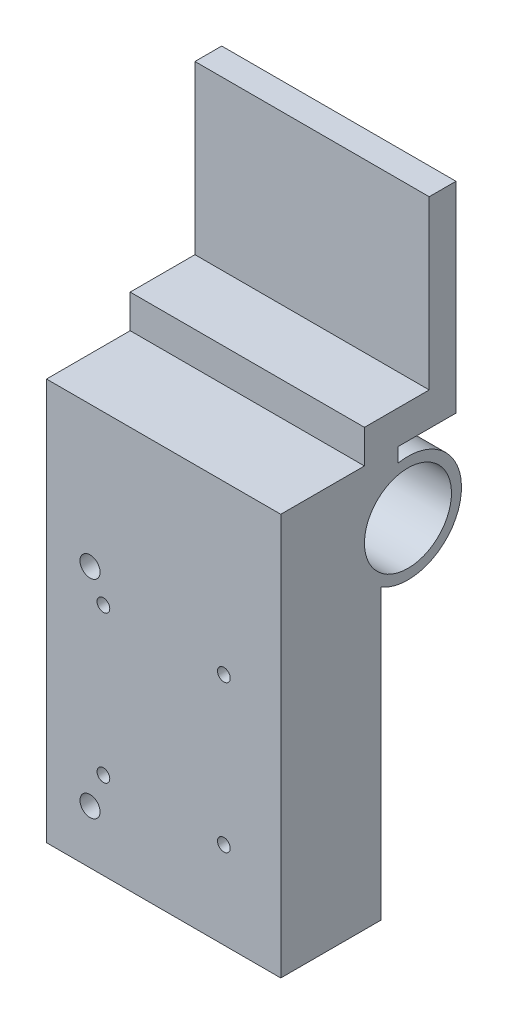
ISO-10303-21;
HEADER;
FILE_DESCRIPTION(('STEP AP214'),'2;1');
FILE_NAME('part.step','',(''),(''),'','','');
FILE_SCHEMA(('AUTOMOTIVE_DESIGN { 1 0 10303 214 1 1 1 1 }'));
ENDSEC;
DATA;
#1=APPLICATION_CONTEXT('core data for automotive mechanical design processes');
#2=APPLICATION_PROTOCOL_DEFINITION('international standard','automotive_design',2000,#1);
#3=PRODUCT_CONTEXT('',#1,'mechanical');
#4=PRODUCT('Part','Part','',(#3));
#5=PRODUCT_RELATED_PRODUCT_CATEGORY('part','',(#4));
#6=PRODUCT_DEFINITION_FORMATION('','',#4);
#7=PRODUCT_DEFINITION_CONTEXT('part definition',#1,'design');
#8=PRODUCT_DEFINITION('design','',#6,#7);
#9=PRODUCT_DEFINITION_SHAPE('','',#8);
#10=(LENGTH_UNIT() NAMED_UNIT(*) SI_UNIT(.MILLI.,.METRE.));
#11=(NAMED_UNIT(*) PLANE_ANGLE_UNIT() SI_UNIT($,.RADIAN.));
#12=(NAMED_UNIT(*) SI_UNIT($,.STERADIAN.) SOLID_ANGLE_UNIT());
#13=UNCERTAINTY_MEASURE_WITH_UNIT(LENGTH_MEASURE(1.E-05),#10,'distance_accuracy_value','');
#14=(GEOMETRIC_REPRESENTATION_CONTEXT(3) GLOBAL_UNCERTAINTY_ASSIGNED_CONTEXT((#13)) GLOBAL_UNIT_ASSIGNED_CONTEXT((#10,
#11,#12)) REPRESENTATION_CONTEXT('',''));
#15=CARTESIAN_POINT('',(0.,0.,0.));
#16=DIRECTION('',(0.,0.,1.));
#17=DIRECTION('',(1.,0.,0.));
#18=AXIS2_PLACEMENT_3D('',#15,#16,#17);
#19=CARTESIAN_POINT('',(0.,60.,0.));
#20=DIRECTION('',(0.,0.,1.));
#21=DIRECTION('',(1.,0.,0.));
#22=AXIS2_PLACEMENT_3D('',#19,#20,#21);
#23=PLANE('',#22);
#24=DIRECTION('',(-1.,0.,0.));
#25=VECTOR('',#24,1.);
#26=CARTESIAN_POINT('',(-23.,56.9282032302755,0.));
#27=LINE('',#26,#25);
#28=CARTESIAN_POINT('',(-12.,56.9282032302755,0.));
#29=VERTEX_POINT('',#28);
#30=CARTESIAN_POINT('',(-23.,56.9282032302755,0.));
#31=VERTEX_POINT('',#30);
#32=EDGE_CURVE('E218',#29,#31,#27,.T.);
#33=ORIENTED_EDGE('',*,*,#32,.F.);
#34=DIRECTION('',(0.,1.,0.));
#35=VECTOR('',#34,1.);
#36=CARTESIAN_POINT('',(-12.,60.,0.));
#37=LINE('',#36,#35);
#38=CARTESIAN_POINT('',(-12.,55.1234753829798,0.));
#39=VERTEX_POINT('',#38);
#40=EDGE_CURVE('E235',#39,#29,#37,.T.);
#41=ORIENTED_EDGE('',*,*,#40,.F.);
#42=DIRECTION('',(-1.,0.,0.));
#43=VECTOR('',#42,1.);
#44=CARTESIAN_POINT('',(0.,55.1234753829798,0.));
#45=LINE('',#44,#43);
#46=CARTESIAN_POINT('',(-23.,55.1234753829798,0.));
#47=VERTEX_POINT('',#46);
#48=EDGE_CURVE('E242',#39,#47,#45,.T.);
#49=ORIENTED_EDGE('',*,*,#48,.T.);
#50=DIRECTION('',(0.,-1.,0.));
#51=VECTOR('',#50,1.);
#52=CARTESIAN_POINT('',(-23.,60.,0.));
#53=LINE('',#52,#51);
#54=EDGE_CURVE('E314',#31,#47,#53,.T.);
#55=ORIENTED_EDGE('',*,*,#54,.F.);
#56=EDGE_LOOP('',(#33,#41,#49,#55));
#57=FACE_BOUND('',#56,.T.);
#58=ADVANCED_FACE('F31',(#57),#23,.F.);
#59=CARTESIAN_POINT('',(0.,0.,15.));
#60=DIRECTION('',(-1.,0.,0.));
#61=DIRECTION('',(0.,0.,1.));
#62=AXIS2_PLACEMENT_3D('',#59,#60,#61);
#63=PLANE('',#62);
#64=DIRECTION('',(0.,1.,0.));
#65=VECTOR('',#64,1.);
#66=CARTESIAN_POINT('',(0.,-0.00100000000000794,2.5));
#67=LINE('',#66,#65);
#68=CARTESIAN_POINT('',(0.,60.,2.5));
#69=VERTEX_POINT('',#68);
#70=CARTESIAN_POINT('',(0.,65.,2.5));
#71=VERTEX_POINT('',#70);
#72=EDGE_CURVE('E211',#69,#71,#67,.T.);
#73=ORIENTED_EDGE('',*,*,#72,.F.);
#74=DIRECTION('',(0.,0.,-1.));
#75=VECTOR('',#74,1.);
#76=CARTESIAN_POINT('',(0.,60.,15.));
#77=LINE('',#76,#75);
#78=CARTESIAN_POINT('',(0.,60.,15.));
#79=VERTEX_POINT('',#78);
#80=EDGE_CURVE('E298',#79,#69,#77,.T.);
#81=ORIENTED_EDGE('',*,*,#80,.F.);
#82=DIRECTION('',(0.,1.,0.));
#83=VECTOR('',#82,1.);
#84=CARTESIAN_POINT('',(0.,0.,15.));
#85=LINE('',#84,#83);
#86=CARTESIAN_POINT('',(0.,0.,15.));
#87=VERTEX_POINT('',#86);
#88=EDGE_CURVE('E274',#87,#79,#85,.T.);
#89=ORIENTED_EDGE('',*,*,#88,.F.);
#90=DIRECTION('',(0.,0.,-1.));
#91=VECTOR('',#90,1.);
#92=CARTESIAN_POINT('',(0.,0.,15.));
#93=LINE('',#92,#91);
#94=CARTESIAN_POINT('',(0.,0.,0.));
#95=VERTEX_POINT('',#94);
#96=EDGE_CURVE('E284',#87,#95,#93,.T.);
#97=ORIENTED_EDGE('',*,*,#96,.T.);
#98=DIRECTION('',(0.,1.,0.));
#99=VECTOR('',#98,1.);
#100=CARTESIAN_POINT('',(0.,0.,0.));
#101=LINE('',#100,#99);
#102=CARTESIAN_POINT('',(0.,43.0717967697245,0.));
#103=VERTEX_POINT('',#102);
#104=EDGE_CURVE('E271',#95,#103,#101,.T.);
#105=ORIENTED_EDGE('',*,*,#104,.T.);
#106=CARTESIAN_POINT('',(0.,50.,-4.00000000000001));
#107=DIRECTION('',(-1.,0.,0.));
#108=DIRECTION('',(0.,-1.,0.));
#109=AXIS2_PLACEMENT_3D('',#106,#107,#108);
#110=CIRCLE('',#109,8.);
#111=CARTESIAN_POINT('',(0.,57.8581168227509,-2.50000000000001));
#112=VERTEX_POINT('',#111);
#113=EDGE_CURVE('E226',#112,#103,#110,.T.);
#114=ORIENTED_EDGE('',*,*,#113,.F.);
#115=DIRECTION('',(0.,1.,0.));
#116=VECTOR('',#115,1.);
#117=CARTESIAN_POINT('',(0.,-0.00100000000000794,-2.50000000000001));
#118=LINE('',#117,#116);
#119=CARTESIAN_POINT('',(0.,60.,-2.5));
#120=VERTEX_POINT('',#119);
#121=EDGE_CURVE('E46',#112,#120,#118,.T.);
#122=ORIENTED_EDGE('',*,*,#121,.T.);
#123=DIRECTION('',(0.,0.,1.));
#124=VECTOR('',#123,1.);
#125=CARTESIAN_POINT('',(0.,60.,-11.175));
#126=LINE('',#125,#124);
#127=CARTESIAN_POINT('',(0.,60.,-11.175));
#128=VERTEX_POINT('',#127);
#129=EDGE_CURVE('E172',#128,#120,#126,.T.);
#130=ORIENTED_EDGE('',*,*,#129,.F.);
#131=DIRECTION('',(0.,-1.,0.));
#132=VECTOR('',#131,1.);
#133=CARTESIAN_POINT('',(0.,90.,-11.175));
#134=LINE('',#133,#132);
#135=CARTESIAN_POINT('',(0.,90.,-11.175));
#136=VERTEX_POINT('',#135);
#137=EDGE_CURVE('E182',#136,#128,#134,.T.);
#138=ORIENTED_EDGE('',*,*,#137,.F.);
#139=DIRECTION('',(0.,0.,-1.));
#140=VECTOR('',#139,1.);
#141=CARTESIAN_POINT('',(0.,90.,-7.17500000000001));
#142=LINE('',#141,#140);
#143=CARTESIAN_POINT('',(0.,90.,-7.17500000000001));
#144=VERTEX_POINT('',#143);
#145=EDGE_CURVE('E179',#144,#136,#142,.T.);
#146=ORIENTED_EDGE('',*,*,#145,.F.);
#147=DIRECTION('',(0.,1.,0.));
#148=VECTOR('',#147,1.);
#149=CARTESIAN_POINT('',(0.,65.,-7.17500000000001));
#150=LINE('',#149,#148);
#151=CARTESIAN_POINT('',(0.,65.,-7.17500000000001));
#152=VERTEX_POINT('',#151);
#153=EDGE_CURVE('E168',#152,#144,#150,.T.);
#154=ORIENTED_EDGE('',*,*,#153,.F.);
#155=DIRECTION('',(0.,0.,-1.));
#156=VECTOR('',#155,1.);
#157=CARTESIAN_POINT('',(0.,65.,2.5));
#158=LINE('',#157,#156);
#159=EDGE_CURVE('E152',#71,#152,#158,.T.);
#160=ORIENTED_EDGE('',*,*,#159,.F.);
#161=EDGE_LOOP('',(#73,#81,#89,#97,#105,#114,#122,#130,#138,#146,#154,#160));
#162=FACE_BOUND('',#161,.T.);
#163=CARTESIAN_POINT('',(0.,50.,-4.00000000000001));
#164=DIRECTION('',(-1.,0.,0.));
#165=DIRECTION('',(0.,-1.,0.));
#166=AXIS2_PLACEMENT_3D('',#163,#164,#165);
#167=CIRCLE('',#166,6.5);
#168=CARTESIAN_POINT('',(0.,43.5,-4.00000000000001));
#169=VERTEX_POINT('',#168);
#170=EDGE_CURVE('E223',#169,#169,#167,.T.);
#171=ORIENTED_EDGE('',*,*,#170,.T.);
#172=EDGE_LOOP('',(#171));
#173=FACE_BOUND('',#172,.T.);
#174=ADVANCED_FACE('F175',(#162,#173),#63,.F.);
#175=CARTESIAN_POINT('',(-12.,50.,-4.00000000000001));
#176=DIRECTION('',(1.,0.,0.));
#177=DIRECTION('',(0.,-1.,0.));
#178=AXIS2_PLACEMENT_3D('',#175,#176,#177);
#179=PLANE('',#178);
#180=CARTESIAN_POINT('',(-12.,50.,-4.00000000000001));
#181=DIRECTION('',(1.,0.,0.));
#182=DIRECTION('',(0.,1.,0.));
#183=AXIS2_PLACEMENT_3D('',#180,#181,#182);
#184=CIRCLE('',#183,6.5);
#185=CARTESIAN_POINT('',(-12.,44.8765246170202,0.));
#186=VERTEX_POINT('',#185);
#187=EDGE_CURVE('E39',#39,#186,#184,.F.);
#188=ORIENTED_EDGE('',*,*,#187,.F.);
#189=ORIENTED_EDGE('',*,*,#40,.T.);
#190=CARTESIAN_POINT('',(-12.,50.,-4.00000000000001));
#191=DIRECTION('',(-1.,0.,0.));
#192=DIRECTION('',(0.,-1.,0.));
#193=AXIS2_PLACEMENT_3D('',#190,#191,#192);
#194=CIRCLE('',#193,8.);
#195=CARTESIAN_POINT('',(-12.,57.8581168227509,-2.5));
#196=VERTEX_POINT('',#195);
#197=EDGE_CURVE('E227',#29,#196,#194,.T.);
#198=ORIENTED_EDGE('',*,*,#197,.T.);
#199=CARTESIAN_POINT('',(-12.,43.0717967697245,0.));
#200=VERTEX_POINT('',#199);
#201=EDGE_CURVE('E231',#196,#200,#194,.T.);
#202=ORIENTED_EDGE('',*,*,#201,.T.);
#203=DIRECTION('',(0.,1.,0.));
#204=VECTOR('',#203,1.);
#205=CARTESIAN_POINT('',(-12.,60.,0.));
#206=LINE('',#205,#204);
#207=EDGE_CURVE('E230',#200,#186,#206,.T.);
#208=ORIENTED_EDGE('',*,*,#207,.T.);
#209=EDGE_LOOP('',(#188,#189,#198,#202,#208));
#210=FACE_BOUND('',#209,.T.);
#211=ADVANCED_FACE('F330',(#210),#179,.F.);
#212=CARTESIAN_POINT('',(-28.5,7.99999999999999,0.));
#213=DIRECTION('',(0.,0.,1.));
#214=DIRECTION('',(1.,0.,0.));
#215=AXIS2_PLACEMENT_3D('',#212,#213,#214);
#216=CIRCLE('',#215,1.5);
#217=CARTESIAN_POINT('',(-27.,7.99999999999999,0.));
#218=VERTEX_POINT('',#217);
#219=EDGE_CURVE('E268',#218,#218,#216,.T.);
#220=ORIENTED_EDGE('',*,*,#219,.T.);
#221=EDGE_LOOP('',(#220));
#222=FACE_BOUND('',#221,.T.);
#223=CARTESIAN_POINT('',(-26.5,13.,0.));
#224=DIRECTION('',(0.,0.,1.));
#225=DIRECTION('',(1.,0.,0.));
#226=AXIS2_PLACEMENT_3D('',#223,#224,#225);
#227=CIRCLE('',#226,0.950000000000001);
#228=CARTESIAN_POINT('',(-25.55,13.,0.));
#229=VERTEX_POINT('',#228);
#230=EDGE_CURVE('E262',#229,#229,#227,.T.);
#231=ORIENTED_EDGE('',*,*,#230,.T.);
#232=EDGE_LOOP('',(#231));
#233=FACE_BOUND('',#232,.T.);
#234=CARTESIAN_POINT('',(-26.5,35.,0.));
#235=DIRECTION('',(0.,0.,1.));
#236=DIRECTION('',(1.,0.,0.));
#237=AXIS2_PLACEMENT_3D('',#234,#235,#236);
#238=CIRCLE('',#237,0.950000000000001);
#239=CARTESIAN_POINT('',(-25.55,35.,0.));
#240=VERTEX_POINT('',#239);
#241=EDGE_CURVE('E256',#240,#240,#238,.T.);
#242=ORIENTED_EDGE('',*,*,#241,.T.);
#243=EDGE_LOOP('',(#242));
#244=FACE_BOUND('',#243,.T.);
#245=CARTESIAN_POINT('',(-28.5,39.,0.));
#246=DIRECTION('',(0.,0.,1.));
#247=DIRECTION('',(1.,0.,0.));
#248=AXIS2_PLACEMENT_3D('',#245,#246,#247);
#249=CIRCLE('',#248,1.5);
#250=CARTESIAN_POINT('',(-27.,39.,0.));
#251=VERTEX_POINT('',#250);
#252=EDGE_CURVE('E250',#251,#251,#249,.T.);
#253=ORIENTED_EDGE('',*,*,#252,.T.);
#254=EDGE_LOOP('',(#253));
#255=FACE_BOUND('',#254,.T.);
#256=CARTESIAN_POINT('',(-8.50000000000001,35.,0.));
#257=DIRECTION('',(0.,0.,-1.));
#258=DIRECTION('',(-1.,0.,0.));
#259=AXIS2_PLACEMENT_3D('',#256,#257,#258);
#260=CIRCLE('',#259,0.950000000000001);
#261=CARTESIAN_POINT('',(-9.45000000000001,35.,0.));
#262=VERTEX_POINT('',#261);
#263=EDGE_CURVE('E307',#262,#262,#260,.T.);
#264=ORIENTED_EDGE('',*,*,#263,.F.);
#265=EDGE_LOOP('',(#264));
#266=FACE_BOUND('',#265,.T.);
#267=CARTESIAN_POINT('',(-8.50000000000001,13.,0.));
#268=DIRECTION('',(0.,0.,-1.));
#269=DIRECTION('',(-1.,0.,0.));
#270=AXIS2_PLACEMENT_3D('',#267,#268,#269);
#271=CIRCLE('',#270,0.950000000000001);
#272=CARTESIAN_POINT('',(-9.45000000000001,13.,0.));
#273=VERTEX_POINT('',#272);
#274=EDGE_CURVE('E301',#273,#273,#271,.T.);
#275=ORIENTED_EDGE('',*,*,#274,.F.);
#276=EDGE_LOOP('',(#275));
#277=FACE_BOUND('',#276,.T.);
#278=DIRECTION('',(1.,0.,0.));
#279=VECTOR('',#278,1.);
#280=CARTESIAN_POINT('',(-12.,43.0717967697245,0.));
#281=LINE('',#280,#279);
#282=EDGE_CURVE('E322',#103,#200,#281,.F.);
#283=ORIENTED_EDGE('',*,*,#282,.F.);
#284=ORIENTED_EDGE('',*,*,#104,.F.);
#285=DIRECTION('',(1.,0.,0.));
#286=VECTOR('',#285,1.);
#287=CARTESIAN_POINT('',(0.,0.,0.));
#288=LINE('',#287,#286);
#289=CARTESIAN_POINT('',(-35.,0.,0.));
#290=VERTEX_POINT('',#289);
#291=EDGE_CURVE('E278',#290,#95,#288,.T.);
#292=ORIENTED_EDGE('',*,*,#291,.F.);
#293=DIRECTION('',(0.,-1.,0.));
#294=VECTOR('',#293,1.);
#295=CARTESIAN_POINT('',(-35.,0.,0.));
#296=LINE('',#295,#294);
#297=CARTESIAN_POINT('',(-35.,43.0717967697245,0.));
#298=VERTEX_POINT('',#297);
#299=EDGE_CURVE('E287',#298,#290,#296,.T.);
#300=ORIENTED_EDGE('',*,*,#299,.F.);
#301=DIRECTION('',(-1.,0.,0.));
#302=VECTOR('',#301,1.);
#303=CARTESIAN_POINT('',(-23.,43.0717967697245,0.));
#304=LINE('',#303,#302);
#305=CARTESIAN_POINT('',(-23.,43.0717967697245,0.));
#306=VERTEX_POINT('',#305);
#307=EDGE_CURVE('E317',#298,#306,#304,.F.);
#308=ORIENTED_EDGE('',*,*,#307,.T.);
#309=CARTESIAN_POINT('',(-23.,44.8765246170202,0.));
#310=VERTEX_POINT('',#309);
#311=EDGE_CURVE('E313',#310,#306,#53,.T.);
#312=ORIENTED_EDGE('',*,*,#311,.F.);
#313=DIRECTION('',(-1.,0.,0.));
#314=VECTOR('',#313,1.);
#315=CARTESIAN_POINT('',(0.,44.8765246170202,0.));
#316=LINE('',#315,#314);
#317=EDGE_CURVE('E53',#310,#186,#316,.F.);
#318=ORIENTED_EDGE('',*,*,#317,.T.);
#319=ORIENTED_EDGE('',*,*,#207,.F.);
#320=EDGE_LOOP('',(#283,#284,#292,#300,#308,#312,#318,#319));
#321=FACE_BOUND('',#320,.T.);
#322=ADVANCED_FACE('F335',(#222,#233,#244,#255,#266,#277,#321),#23,.F.);
#323=CARTESIAN_POINT('',(0.,50.,-4.00000000000001));
#324=DIRECTION('',(-1.,0.,0.));
#325=DIRECTION('',(0.,-1.,0.));
#326=AXIS2_PLACEMENT_3D('',#323,#324,#325);
#327=CYLINDRICAL_SURFACE('',#326,6.5);
#328=CARTESIAN_POINT('',(-35.,50.,-4.00000000000001));
#329=DIRECTION('',(-1.,0.,0.));
#330=DIRECTION('',(0.,-1.,0.));
#331=AXIS2_PLACEMENT_3D('',#328,#329,#330);
#332=CIRCLE('',#331,6.5);
#333=CARTESIAN_POINT('',(-35.,43.5,-4.00000000000001));
#334=VERTEX_POINT('',#333);
#335=EDGE_CURVE('E238',#334,#334,#332,.T.);
#336=ORIENTED_EDGE('',*,*,#335,.T.);
#337=EDGE_LOOP('',(#336));
#338=FACE_BOUND('',#337,.T.);
#339=ORIENTED_EDGE('',*,*,#48,.F.);
#340=ORIENTED_EDGE('',*,*,#187,.T.);
#341=ORIENTED_EDGE('',*,*,#317,.F.);
#342=CARTESIAN_POINT('',(-23.,50.,-4.00000000000001));
#343=DIRECTION('',(-1.,0.,0.));
#344=DIRECTION('',(0.,-1.,0.));
#345=AXIS2_PLACEMENT_3D('',#342,#343,#344);
#346=CIRCLE('',#345,6.5);
#347=EDGE_CURVE('E320',#47,#310,#346,.T.);
#348=ORIENTED_EDGE('',*,*,#347,.F.);
#349=EDGE_LOOP('',(#339,#340,#341,#348));
#350=FACE_BOUND('',#349,.T.);
#351=ORIENTED_EDGE('',*,*,#170,.F.);
#352=EDGE_LOOP('',(#351));
#353=FACE_BOUND('',#352,.T.);
#354=ADVANCED_FACE('F325',(#338,#350,#353),#327,.F.);
#355=CARTESIAN_POINT('',(-8.50000000000001,35.,0.));
#356=DIRECTION('',(0.,0.,1.));
#357=DIRECTION('',(-1.,0.,0.));
#358=AXIS2_PLACEMENT_3D('',#355,#356,#357);
#359=CYLINDRICAL_SURFACE('',#358,0.950000000000001);
#360=ORIENTED_EDGE('',*,*,#263,.T.);
#361=EDGE_LOOP('',(#360));
#362=FACE_BOUND('',#361,.T.);
#363=CARTESIAN_POINT('',(-8.50000000000001,35.,15.));
#364=DIRECTION('',(0.,0.,-1.));
#365=DIRECTION('',(-1.,0.,0.));
#366=AXIS2_PLACEMENT_3D('',#363,#364,#365);
#367=CIRCLE('',#366,0.950000000000001);
#368=CARTESIAN_POINT('',(-9.45000000000001,35.,15.));
#369=VERTEX_POINT('',#368);
#370=EDGE_CURVE('E310',#369,#369,#367,.T.);
#371=ORIENTED_EDGE('',*,*,#370,.F.);
#372=EDGE_LOOP('',(#371));
#373=FACE_BOUND('',#372,.T.);
#374=ADVANCED_FACE('F33',(#362,#373),#359,.F.);
#375=CARTESIAN_POINT('',(-8.50000000000001,13.,0.));
#376=DIRECTION('',(0.,0.,1.));
#377=DIRECTION('',(-1.,0.,0.));
#378=AXIS2_PLACEMENT_3D('',#375,#376,#377);
#379=CYLINDRICAL_SURFACE('',#378,0.950000000000001);
#380=ORIENTED_EDGE('',*,*,#274,.T.);
#381=EDGE_LOOP('',(#380));
#382=FACE_BOUND('',#381,.T.);
#383=CARTESIAN_POINT('',(-8.50000000000001,13.,15.));
#384=DIRECTION('',(0.,0.,-1.));
#385=DIRECTION('',(-1.,0.,0.));
#386=AXIS2_PLACEMENT_3D('',#383,#384,#385);
#387=CIRCLE('',#386,0.950000000000001);
#388=CARTESIAN_POINT('',(-9.45000000000001,13.,15.));
#389=VERTEX_POINT('',#388);
#390=EDGE_CURVE('E304',#389,#389,#387,.T.);
#391=ORIENTED_EDGE('',*,*,#390,.F.);
#392=EDGE_LOOP('',(#391));
#393=FACE_BOUND('',#392,.T.);
#394=ADVANCED_FACE('F427',(#382,#393),#379,.F.);
#395=CARTESIAN_POINT('',(0.,60.,15.));
#396=DIRECTION('',(0.,-1.,0.));
#397=DIRECTION('',(0.,0.,-1.));
#398=AXIS2_PLACEMENT_3D('',#395,#396,#397);
#399=PLANE('',#398);
#400=ORIENTED_EDGE('',*,*,#80,.T.);
#401=DIRECTION('',(-1.,0.,0.));
#402=VECTOR('',#401,1.);
#403=CARTESIAN_POINT('',(0.,60.,2.5));
#404=LINE('',#403,#402);
#405=CARTESIAN_POINT('',(-35.,60.,2.5));
#406=VERTEX_POINT('',#405);
#407=EDGE_CURVE('E220',#69,#406,#404,.T.);
#408=ORIENTED_EDGE('',*,*,#407,.T.);
#409=DIRECTION('',(0.,0.,-1.));
#410=VECTOR('',#409,1.);
#411=CARTESIAN_POINT('',(-35.,60.,15.));
#412=LINE('',#411,#410);
#413=CARTESIAN_POINT('',(-35.,60.,15.));
#414=VERTEX_POINT('',#413);
#415=EDGE_CURVE('E295',#414,#406,#412,.T.);
#416=ORIENTED_EDGE('',*,*,#415,.F.);
#417=DIRECTION('',(-1.,0.,0.));
#418=VECTOR('',#417,1.);
#419=CARTESIAN_POINT('',(0.,60.,15.));
#420=LINE('',#419,#418);
#421=EDGE_CURVE('E277',#79,#414,#420,.T.);
#422=ORIENTED_EDGE('',*,*,#421,.F.);
#423=EDGE_LOOP('',(#400,#408,#416,#422));
#424=FACE_BOUND('',#423,.T.);
#425=ADVANCED_FACE('F384',(#424),#399,.F.);
#426=CARTESIAN_POINT('',(-35.,0.,15.));
#427=DIRECTION('',(1.,0.,0.));
#428=DIRECTION('',(0.,1.,0.));
#429=AXIS2_PLACEMENT_3D('',#426,#427,#428);
#430=PLANE('',#429);
#431=ORIENTED_EDGE('',*,*,#335,.F.);
#432=EDGE_LOOP('',(#431));
#433=FACE_BOUND('',#432,.T.);
#434=ORIENTED_EDGE('',*,*,#415,.T.);
#435=DIRECTION('',(0.,1.,0.));
#436=VECTOR('',#435,1.);
#437=CARTESIAN_POINT('',(-35.,-0.00100000000000794,2.5));
#438=LINE('',#437,#436);
#439=CARTESIAN_POINT('',(-35.,65.,2.5));
#440=VERTEX_POINT('',#439);
#441=EDGE_CURVE('E163',#406,#440,#438,.T.);
#442=ORIENTED_EDGE('',*,*,#441,.T.);
#443=DIRECTION('',(0.,0.,1.));
#444=VECTOR('',#443,1.);
#445=CARTESIAN_POINT('',(-35.,65.,2.5));
#446=LINE('',#445,#444);
#447=CARTESIAN_POINT('',(-35.,65.,-7.17500000000001));
#448=VERTEX_POINT('',#447);
#449=EDGE_CURVE('E199',#448,#440,#446,.T.);
#450=ORIENTED_EDGE('',*,*,#449,.F.);
#451=DIRECTION('',(0.,1.,0.));
#452=VECTOR('',#451,1.);
#453=CARTESIAN_POINT('',(-35.,65.,-7.17500000000001));
#454=LINE('',#453,#452);
#455=CARTESIAN_POINT('',(-35.,90.,-7.17500000000001));
#456=VERTEX_POINT('',#455);
#457=EDGE_CURVE('E170',#448,#456,#454,.T.);
#458=ORIENTED_EDGE('',*,*,#457,.T.);
#459=DIRECTION('',(0.,0.,-1.));
#460=VECTOR('',#459,1.);
#461=CARTESIAN_POINT('',(-35.,90.,-7.17500000000001));
#462=LINE('',#461,#460);
#463=CARTESIAN_POINT('',(-35.,90.,-11.175));
#464=VERTEX_POINT('',#463);
#465=EDGE_CURVE('E192',#456,#464,#462,.T.);
#466=ORIENTED_EDGE('',*,*,#465,.T.);
#467=DIRECTION('',(0.,-1.,0.));
#468=VECTOR('',#467,1.);
#469=CARTESIAN_POINT('',(-35.,90.,-11.175));
#470=LINE('',#469,#468);
#471=CARTESIAN_POINT('',(-35.,60.,-11.175));
#472=VERTEX_POINT('',#471);
#473=EDGE_CURVE('E185',#464,#472,#470,.T.);
#474=ORIENTED_EDGE('',*,*,#473,.T.);
#475=DIRECTION('',(0.,0.,1.));
#476=VECTOR('',#475,1.);
#477=CARTESIAN_POINT('',(-35.,60.,-11.175));
#478=LINE('',#477,#476);
#479=CARTESIAN_POINT('',(-35.,60.,-2.5));
#480=VERTEX_POINT('',#479);
#481=EDGE_CURVE('E180',#472,#480,#478,.T.);
#482=ORIENTED_EDGE('',*,*,#481,.T.);
#483=DIRECTION('',(0.,1.,0.));
#484=VECTOR('',#483,1.);
#485=CARTESIAN_POINT('',(-35.,-0.00100000000000794,-2.5));
#486=LINE('',#485,#484);
#487=CARTESIAN_POINT('',(-35.,57.8581168227509,-2.5));
#488=VERTEX_POINT('',#487);
#489=EDGE_CURVE('E207',#488,#480,#486,.T.);
#490=ORIENTED_EDGE('',*,*,#489,.F.);
#491=CARTESIAN_POINT('',(-35.,50.,-4.00000000000001));
#492=DIRECTION('',(-1.,0.,0.));
#493=DIRECTION('',(0.,-1.,0.));
#494=AXIS2_PLACEMENT_3D('',#491,#492,#493);
#495=CIRCLE('',#494,8.);
#496=EDGE_CURVE('E244',#488,#298,#495,.T.);
#497=ORIENTED_EDGE('',*,*,#496,.T.);
#498=ORIENTED_EDGE('',*,*,#299,.T.);
#499=DIRECTION('',(0.,0.,-1.));
#500=VECTOR('',#499,1.);
#501=CARTESIAN_POINT('',(-35.,0.,15.));
#502=LINE('',#501,#500);
#503=CARTESIAN_POINT('',(-35.,0.,15.));
#504=VERTEX_POINT('',#503);
#505=EDGE_CURVE('E292',#504,#290,#502,.T.);
#506=ORIENTED_EDGE('',*,*,#505,.F.);
#507=DIRECTION('',(0.,-1.,0.));
#508=VECTOR('',#507,1.);
#509=CARTESIAN_POINT('',(-35.,0.,15.));
#510=LINE('',#509,#508);
#511=EDGE_CURVE('E280',#414,#504,#510,.T.);
#512=ORIENTED_EDGE('',*,*,#511,.F.);
#513=EDGE_LOOP('',(#434,#442,#450,#458,#466,#474,#482,#490,#497,#498,#506,#512));
#514=FACE_BOUND('',#513,.T.);
#515=ADVANCED_FACE('F363',(#433,#514),#430,.F.);
#516=CARTESIAN_POINT('',(0.,0.,15.));
#517=DIRECTION('',(0.,1.,0.));
#518=DIRECTION('',(-1.,0.,0.));
#519=AXIS2_PLACEMENT_3D('',#516,#517,#518);
#520=PLANE('',#519);
#521=ORIENTED_EDGE('',*,*,#291,.T.);
#522=ORIENTED_EDGE('',*,*,#96,.F.);
#523=DIRECTION('',(1.,0.,0.));
#524=VECTOR('',#523,1.);
#525=CARTESIAN_POINT('',(0.,0.,15.));
#526=LINE('',#525,#524);
#527=EDGE_CURVE('E282',#504,#87,#526,.T.);
#528=ORIENTED_EDGE('',*,*,#527,.F.);
#529=ORIENTED_EDGE('',*,*,#505,.T.);
#530=EDGE_LOOP('',(#521,#522,#528,#529));
#531=FACE_BOUND('',#530,.T.);
#532=ADVANCED_FACE('F360',(#531),#520,.F.);
#533=CARTESIAN_POINT('',(0.,60.,15.));
#534=DIRECTION('',(0.,0.,1.));
#535=DIRECTION('',(1.,0.,0.));
#536=AXIS2_PLACEMENT_3D('',#533,#534,#535);
#537=PLANE('',#536);
#538=ORIENTED_EDGE('',*,*,#390,.T.);
#539=EDGE_LOOP('',(#538));
#540=FACE_BOUND('',#539,.T.);
#541=ORIENTED_EDGE('',*,*,#370,.T.);
#542=EDGE_LOOP('',(#541));
#543=FACE_BOUND('',#542,.T.);
#544=CARTESIAN_POINT('',(-28.5,39.,15.));
#545=DIRECTION('',(0.,0.,1.));
#546=DIRECTION('',(1.,0.,0.));
#547=AXIS2_PLACEMENT_3D('',#544,#545,#546);
#548=CIRCLE('',#547,1.5);
#549=CARTESIAN_POINT('',(-27.,39.,15.));
#550=VERTEX_POINT('',#549);
#551=EDGE_CURVE('E247',#550,#550,#548,.T.);
#552=ORIENTED_EDGE('',*,*,#551,.F.);
#553=EDGE_LOOP('',(#552));
#554=FACE_BOUND('',#553,.T.);
#555=CARTESIAN_POINT('',(-26.5,35.,15.));
#556=DIRECTION('',(0.,0.,1.));
#557=DIRECTION('',(1.,0.,0.));
#558=AXIS2_PLACEMENT_3D('',#555,#556,#557);
#559=CIRCLE('',#558,0.950000000000001);
#560=CARTESIAN_POINT('',(-25.55,35.,15.));
#561=VERTEX_POINT('',#560);
#562=EDGE_CURVE('E253',#561,#561,#559,.T.);
#563=ORIENTED_EDGE('',*,*,#562,.F.);
#564=EDGE_LOOP('',(#563));
#565=FACE_BOUND('',#564,.T.);
#566=CARTESIAN_POINT('',(-26.5,13.,15.));
#567=DIRECTION('',(0.,0.,1.));
#568=DIRECTION('',(1.,0.,0.));
#569=AXIS2_PLACEMENT_3D('',#566,#567,#568);
#570=CIRCLE('',#569,0.950000000000001);
#571=CARTESIAN_POINT('',(-25.55,13.,15.));
#572=VERTEX_POINT('',#571);
#573=EDGE_CURVE('E259',#572,#572,#570,.T.);
#574=ORIENTED_EDGE('',*,*,#573,.F.);
#575=EDGE_LOOP('',(#574));
#576=FACE_BOUND('',#575,.T.);
#577=CARTESIAN_POINT('',(-28.5,7.99999999999999,15.));
#578=DIRECTION('',(0.,0.,1.));
#579=DIRECTION('',(1.,0.,0.));
#580=AXIS2_PLACEMENT_3D('',#577,#578,#579);
#581=CIRCLE('',#580,1.5);
#582=CARTESIAN_POINT('',(-27.,7.99999999999999,15.));
#583=VERTEX_POINT('',#582);
#584=EDGE_CURVE('E265',#583,#583,#581,.T.);
#585=ORIENTED_EDGE('',*,*,#584,.F.);
#586=EDGE_LOOP('',(#585));
#587=FACE_BOUND('',#586,.T.);
#588=ORIENTED_EDGE('',*,*,#88,.T.);
#589=ORIENTED_EDGE('',*,*,#421,.T.);
#590=ORIENTED_EDGE('',*,*,#511,.T.);
#591=ORIENTED_EDGE('',*,*,#527,.T.);
#592=EDGE_LOOP('',(#588,#589,#590,#591));
#593=FACE_BOUND('',#592,.T.);
#594=ADVANCED_FACE('F386',(#540,#543,#554,#565,#576,#587,#593),#537,.T.);
#595=CARTESIAN_POINT('',(-28.5,7.99999999999999,0.));
#596=DIRECTION('',(0.,0.,1.));
#597=DIRECTION('',(1.,0.,0.));
#598=AXIS2_PLACEMENT_3D('',#595,#596,#597);
#599=CYLINDRICAL_SURFACE('',#598,1.5);
#600=ORIENTED_EDGE('',*,*,#219,.F.);
#601=EDGE_LOOP('',(#600));
#602=FACE_BOUND('',#601,.T.);
#603=ORIENTED_EDGE('',*,*,#584,.T.);
#604=EDGE_LOOP('',(#603));
#605=FACE_BOUND('',#604,.T.);
#606=ADVANCED_FACE('F388',(#602,#605),#599,.F.);
#607=CARTESIAN_POINT('',(-26.5,13.,0.));
#608=DIRECTION('',(0.,0.,1.));
#609=DIRECTION('',(1.,0.,0.));
#610=AXIS2_PLACEMENT_3D('',#607,#608,#609);
#611=CYLINDRICAL_SURFACE('',#610,0.950000000000001);
#612=ORIENTED_EDGE('',*,*,#230,.F.);
#613=EDGE_LOOP('',(#612));
#614=FACE_BOUND('',#613,.T.);
#615=ORIENTED_EDGE('',*,*,#573,.T.);
#616=EDGE_LOOP('',(#615));
#617=FACE_BOUND('',#616,.T.);
#618=ADVANCED_FACE('F395',(#614,#617),#611,.F.);
#619=CARTESIAN_POINT('',(-26.5,35.,0.));
#620=DIRECTION('',(0.,0.,1.));
#621=DIRECTION('',(1.,0.,0.));
#622=AXIS2_PLACEMENT_3D('',#619,#620,#621);
#623=CYLINDRICAL_SURFACE('',#622,0.950000000000001);
#624=ORIENTED_EDGE('',*,*,#241,.F.);
#625=EDGE_LOOP('',(#624));
#626=FACE_BOUND('',#625,.T.);
#627=ORIENTED_EDGE('',*,*,#562,.T.);
#628=EDGE_LOOP('',(#627));
#629=FACE_BOUND('',#628,.T.);
#630=ADVANCED_FACE('F468',(#626,#629),#623,.F.);
#631=CARTESIAN_POINT('',(-28.5,39.,0.));
#632=DIRECTION('',(0.,0.,1.));
#633=DIRECTION('',(1.,0.,0.));
#634=AXIS2_PLACEMENT_3D('',#631,#632,#633);
#635=CYLINDRICAL_SURFACE('',#634,1.5);
#636=ORIENTED_EDGE('',*,*,#252,.F.);
#637=EDGE_LOOP('',(#636));
#638=FACE_BOUND('',#637,.T.);
#639=ORIENTED_EDGE('',*,*,#551,.T.);
#640=EDGE_LOOP('',(#639));
#641=FACE_BOUND('',#640,.T.);
#642=ADVANCED_FACE('F478',(#638,#641),#635,.F.);
#643=CARTESIAN_POINT('',(-23.,50.,-4.00000000000001));
#644=DIRECTION('',(-1.,0.,0.));
#645=DIRECTION('',(0.,-1.,0.));
#646=AXIS2_PLACEMENT_3D('',#643,#644,#645);
#647=CYLINDRICAL_SURFACE('',#646,8.);
#648=DIRECTION('',(-1.,0.,0.));
#649=VECTOR('',#648,1.);
#650=CARTESIAN_POINT('',(-23.,57.8581168227509,-2.5));
#651=LINE('',#650,#649);
#652=CARTESIAN_POINT('',(-23.,57.8581168227509,-2.5));
#653=VERTEX_POINT('',#652);
#654=EDGE_CURVE('E215',#488,#653,#651,.F.);
#655=ORIENTED_EDGE('',*,*,#654,.T.);
#656=CARTESIAN_POINT('',(-23.,50.,-4.00000000000001));
#657=DIRECTION('',(-1.,0.,0.));
#658=DIRECTION('',(0.,-1.,0.));
#659=AXIS2_PLACEMENT_3D('',#656,#657,#658);
#660=CIRCLE('',#659,8.);
#661=EDGE_CURVE('E248',#653,#306,#660,.T.);
#662=ORIENTED_EDGE('',*,*,#661,.T.);
#663=ORIENTED_EDGE('',*,*,#307,.F.);
#664=ORIENTED_EDGE('',*,*,#496,.F.);
#665=EDGE_LOOP('',(#655,#662,#663,#664));
#666=FACE_BOUND('',#665,.T.);
#667=ADVANCED_FACE('F368',(#666),#647,.T.);
#668=CARTESIAN_POINT('',(-23.,50.,-4.00000000000001));
#669=DIRECTION('',(-1.,0.,0.));
#670=DIRECTION('',(0.,-1.,0.));
#671=AXIS2_PLACEMENT_3D('',#668,#669,#670);
#672=PLANE('',#671);
#673=ORIENTED_EDGE('',*,*,#54,.T.);
#674=ORIENTED_EDGE('',*,*,#347,.T.);
#675=ORIENTED_EDGE('',*,*,#311,.T.);
#676=ORIENTED_EDGE('',*,*,#661,.F.);
#677=EDGE_CURVE('E245',#31,#653,#660,.T.);
#678=ORIENTED_EDGE('',*,*,#677,.F.);
#679=EDGE_LOOP('',(#673,#674,#675,#676,#678));
#680=FACE_BOUND('',#679,.T.);
#681=ADVANCED_FACE('F341',(#680),#672,.F.);
#682=CARTESIAN_POINT('',(-12.,50.,-4.00000000000001));
#683=DIRECTION('',(1.,0.,0.));
#684=DIRECTION('',(0.,1.,0.));
#685=AXIS2_PLACEMENT_3D('',#682,#683,#684);
#686=CYLINDRICAL_SURFACE('',#685,8.);
#687=ORIENTED_EDGE('',*,*,#201,.F.);
#688=DIRECTION('',(1.,0.,0.));
#689=VECTOR('',#688,1.);
#690=CARTESIAN_POINT('',(-12.,57.8581168227509,-2.50000000000001));
#691=LINE('',#690,#689);
#692=EDGE_CURVE('E11',#196,#112,#691,.T.);
#693=ORIENTED_EDGE('',*,*,#692,.T.);
#694=ORIENTED_EDGE('',*,*,#113,.T.);
#695=ORIENTED_EDGE('',*,*,#282,.T.);
#696=EDGE_LOOP('',(#687,#693,#694,#695));
#697=FACE_BOUND('',#696,.T.);
#698=ADVANCED_FACE('F351',(#697),#686,.T.);
#699=CARTESIAN_POINT('',(-35.,-0.00100000000000794,2.5));
#700=DIRECTION('',(0.,0.,1.));
#701=DIRECTION('',(1.,0.,0.));
#702=AXIS2_PLACEMENT_3D('',#699,#700,#701);
#703=PLANE('',#702);
#704=ORIENTED_EDGE('',*,*,#407,.F.);
#705=ORIENTED_EDGE('',*,*,#72,.T.);
#706=DIRECTION('',(1.,0.,0.));
#707=VECTOR('',#706,1.);
#708=CARTESIAN_POINT('',(-35.,65.,2.5));
#709=LINE('',#708,#707);
#710=EDGE_CURVE('E159',#440,#71,#709,.T.);
#711=ORIENTED_EDGE('',*,*,#710,.F.);
#712=ORIENTED_EDGE('',*,*,#441,.F.);
#713=EDGE_LOOP('',(#704,#705,#711,#712));
#714=FACE_BOUND('',#713,.T.);
#715=ADVANCED_FACE('F382',(#714),#703,.T.);
#716=CARTESIAN_POINT('',(-23.,50.,-4.00000000000001));
#717=DIRECTION('',(-1.,0.,0.));
#718=DIRECTION('',(0.,-1.,0.));
#719=AXIS2_PLACEMENT_3D('',#716,#717,#718);
#720=CYLINDRICAL_SURFACE('',#719,8.);
#721=EDGE_CURVE('E210',#653,#196,#651,.F.);
#722=ORIENTED_EDGE('',*,*,#721,.T.);
#723=ORIENTED_EDGE('',*,*,#197,.F.);
#724=ORIENTED_EDGE('',*,*,#32,.T.);
#725=ORIENTED_EDGE('',*,*,#677,.T.);
#726=EDGE_LOOP('',(#722,#723,#724,#725));
#727=FACE_BOUND('',#726,.T.);
#728=ADVANCED_FACE('F348',(#727),#720,.F.);
#729=CARTESIAN_POINT('',(-35.,-0.00100000000000794,-2.5));
#730=DIRECTION('',(0.,0.,-1.));
#731=DIRECTION('',(-1.,0.,0.));
#732=AXIS2_PLACEMENT_3D('',#729,#730,#731);
#733=PLANE('',#732);
#734=DIRECTION('',(-1.,0.,0.));
#735=VECTOR('',#734,1.);
#736=CARTESIAN_POINT('',(0.,60.,-2.5));
#737=LINE('',#736,#735);
#738=EDGE_CURVE('E197',#120,#480,#737,.T.);
#739=ORIENTED_EDGE('',*,*,#738,.F.);
#740=ORIENTED_EDGE('',*,*,#121,.F.);
#741=ORIENTED_EDGE('',*,*,#692,.F.);
#742=ORIENTED_EDGE('',*,*,#721,.F.);
#743=ORIENTED_EDGE('',*,*,#654,.F.);
#744=ORIENTED_EDGE('',*,*,#489,.T.);
#745=EDGE_LOOP('',(#739,#740,#741,#742,#743,#744));
#746=FACE_BOUND('',#745,.T.);
#747=ADVANCED_FACE('F369',(#746),#733,.T.);
#748=CARTESIAN_POINT('',(-35.,65.,-2.5));
#749=DIRECTION('',(0.,-1.,0.));
#750=DIRECTION('',(0.,0.,-1.));
#751=AXIS2_PLACEMENT_3D('',#748,#749,#750);
#752=PLANE('',#751);
#753=ORIENTED_EDGE('',*,*,#449,.T.);
#754=ORIENTED_EDGE('',*,*,#710,.T.);
#755=ORIENTED_EDGE('',*,*,#159,.T.);
#756=DIRECTION('',(-1.,0.,0.));
#757=VECTOR('',#756,1.);
#758=CARTESIAN_POINT('',(0.,65.,-7.17500000000001));
#759=LINE('',#758,#757);
#760=EDGE_CURVE('E156',#152,#448,#759,.T.);
#761=ORIENTED_EDGE('',*,*,#760,.T.);
#762=EDGE_LOOP('',(#753,#754,#755,#761));
#763=FACE_BOUND('',#762,.T.);
#764=ADVANCED_FACE('F155',(#763),#752,.F.);
#765=CARTESIAN_POINT('',(0.,60.,-11.175));
#766=DIRECTION('',(0.,-1.,0.));
#767=DIRECTION('',(1.,0.,0.));
#768=AXIS2_PLACEMENT_3D('',#765,#766,#767);
#769=PLANE('',#768);
#770=ORIENTED_EDGE('',*,*,#481,.F.);
#771=DIRECTION('',(-1.,0.,0.));
#772=VECTOR('',#771,1.);
#773=CARTESIAN_POINT('',(0.,60.,-11.175));
#774=LINE('',#773,#772);
#775=EDGE_CURVE('E200',#128,#472,#774,.T.);
#776=ORIENTED_EDGE('',*,*,#775,.F.);
#777=ORIENTED_EDGE('',*,*,#129,.T.);
#778=ORIENTED_EDGE('',*,*,#738,.T.);
#779=EDGE_LOOP('',(#770,#776,#777,#778));
#780=FACE_BOUND('',#779,.T.);
#781=ADVANCED_FACE('F373',(#780),#769,.T.);
#782=CARTESIAN_POINT('',(0.,90.,-11.175));
#783=DIRECTION('',(0.,0.,-1.));
#784=DIRECTION('',(-1.,0.,0.));
#785=AXIS2_PLACEMENT_3D('',#782,#783,#784);
#786=PLANE('',#785);
#787=ORIENTED_EDGE('',*,*,#473,.F.);
#788=DIRECTION('',(-1.,0.,0.));
#789=VECTOR('',#788,1.);
#790=CARTESIAN_POINT('',(0.,90.,-11.175));
#791=LINE('',#790,#789);
#792=EDGE_CURVE('E202',#136,#464,#791,.T.);
#793=ORIENTED_EDGE('',*,*,#792,.F.);
#794=ORIENTED_EDGE('',*,*,#137,.T.);
#795=ORIENTED_EDGE('',*,*,#775,.T.);
#796=EDGE_LOOP('',(#787,#793,#794,#795));
#797=FACE_BOUND('',#796,.T.);
#798=ADVANCED_FACE('F376',(#797),#786,.T.);
#799=CARTESIAN_POINT('',(0.,90.,-7.17500000000001));
#800=DIRECTION('',(0.,1.,0.));
#801=DIRECTION('',(-1.,0.,0.));
#802=AXIS2_PLACEMENT_3D('',#799,#800,#801);
#803=PLANE('',#802);
#804=ORIENTED_EDGE('',*,*,#465,.F.);
#805=DIRECTION('',(-1.,0.,0.));
#806=VECTOR('',#805,1.);
#807=CARTESIAN_POINT('',(0.,90.,-7.17500000000001));
#808=LINE('',#807,#806);
#809=EDGE_CURVE('E171',#144,#456,#808,.T.);
#810=ORIENTED_EDGE('',*,*,#809,.F.);
#811=ORIENTED_EDGE('',*,*,#145,.T.);
#812=ORIENTED_EDGE('',*,*,#792,.T.);
#813=EDGE_LOOP('',(#804,#810,#811,#812));
#814=FACE_BOUND('',#813,.T.);
#815=ADVANCED_FACE('F379',(#814),#803,.T.);
#816=CARTESIAN_POINT('',(0.,65.,-7.17500000000001));
#817=DIRECTION('',(0.,0.,1.));
#818=DIRECTION('',(1.,0.,0.));
#819=AXIS2_PLACEMENT_3D('',#816,#817,#818);
#820=PLANE('',#819);
#821=ORIENTED_EDGE('',*,*,#457,.F.);
#822=ORIENTED_EDGE('',*,*,#760,.F.);
#823=ORIENTED_EDGE('',*,*,#153,.T.);
#824=ORIENTED_EDGE('',*,*,#809,.T.);
#825=EDGE_LOOP('',(#821,#822,#823,#824));
#826=FACE_BOUND('',#825,.T.);
#827=ADVANCED_FACE('F167',(#826),#820,.T.);
#828=CLOSED_SHELL('',(#58,#174,#211,#322,#354,#374,#394,#425,#515,#532,#594,#606,#618,#630,#642,
#667,#681,#698,#715,#728,#747,#764,#781,#798,#815,#827));
#829=MANIFOLD_SOLID_BREP('B2',#828);
#830=ADVANCED_BREP_SHAPE_REPRESENTATION('',(#18,#829),#14);
#831=SHAPE_DEFINITION_REPRESENTATION(#9,#830);
ENDSEC;
END-ISO-10303-21;
